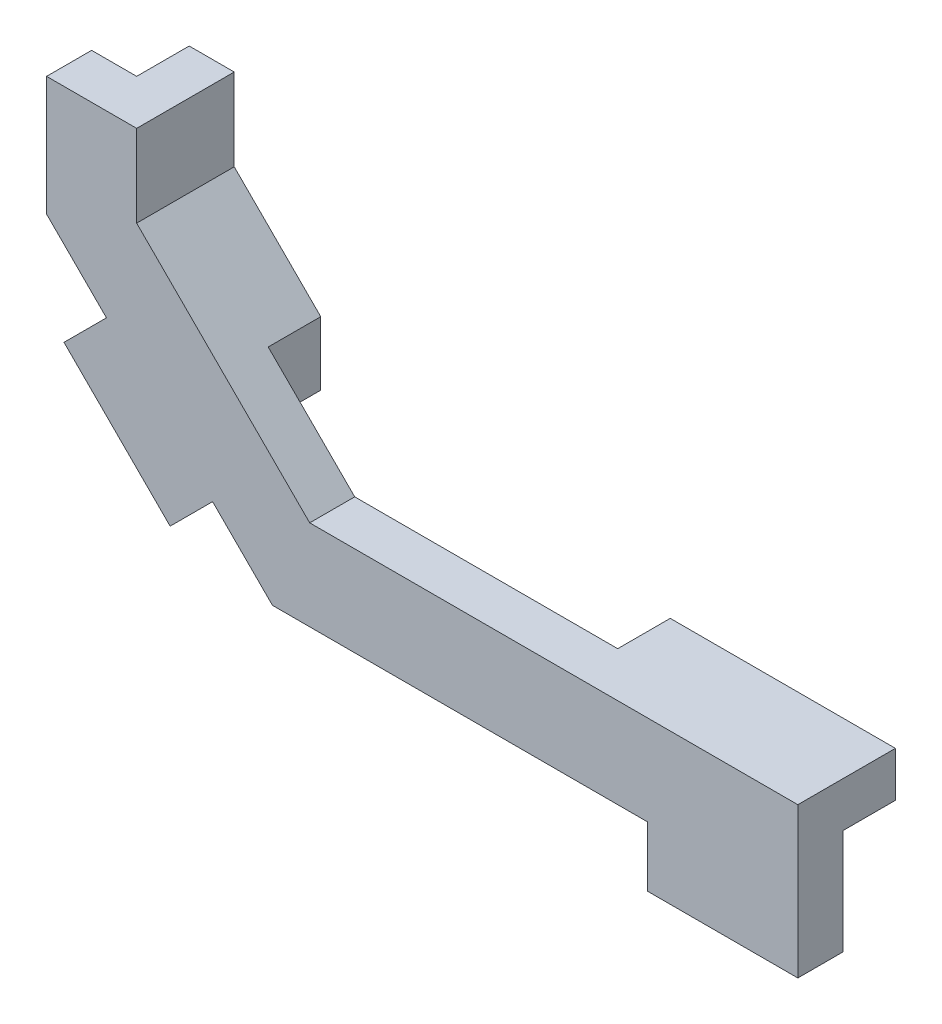
ISO-10303-21;
HEADER;
FILE_DESCRIPTION(('STEP AP214'),'2;1');
FILE_NAME('part.step','',(''),(''),'','','');
FILE_SCHEMA(('AUTOMOTIVE_DESIGN { 1 0 10303 214 1 1 1 1 }'));
ENDSEC;
DATA;
#1=APPLICATION_CONTEXT('core data for automotive mechanical design processes');
#2=APPLICATION_PROTOCOL_DEFINITION('international standard','automotive_design',2000,#1);
#3=PRODUCT_CONTEXT('',#1,'mechanical');
#4=PRODUCT('Part','Part','',(#3));
#5=PRODUCT_RELATED_PRODUCT_CATEGORY('part','',(#4));
#6=PRODUCT_DEFINITION_FORMATION('','',#4);
#7=PRODUCT_DEFINITION_CONTEXT('part definition',#1,'design');
#8=PRODUCT_DEFINITION('design','',#6,#7);
#9=PRODUCT_DEFINITION_SHAPE('','',#8);
#10=(LENGTH_UNIT() NAMED_UNIT(*) SI_UNIT(.MILLI.,.METRE.));
#11=(NAMED_UNIT(*) PLANE_ANGLE_UNIT() SI_UNIT($,.RADIAN.));
#12=(NAMED_UNIT(*) SI_UNIT($,.STERADIAN.) SOLID_ANGLE_UNIT());
#13=UNCERTAINTY_MEASURE_WITH_UNIT(LENGTH_MEASURE(1.E-05),#10,'distance_accuracy_value','');
#14=(GEOMETRIC_REPRESENTATION_CONTEXT(3) GLOBAL_UNCERTAINTY_ASSIGNED_CONTEXT((#13)) GLOBAL_UNIT_ASSIGNED_CONTEXT((#10,
#11,#12)) REPRESENTATION_CONTEXT('',''));
#15=CARTESIAN_POINT('',(0.,0.,0.));
#16=DIRECTION('',(0.,0.,1.));
#17=DIRECTION('',(1.,0.,0.));
#18=AXIS2_PLACEMENT_3D('',#15,#16,#17);
#19=CARTESIAN_POINT('',(-17.5,0.,30.414988602006));
#20=DIRECTION('',(-0.707106781186549,-0.707106781186546,0.));
#21=DIRECTION('',(0.707106781186546,-0.707106781186549,0.));
#22=AXIS2_PLACEMENT_3D('',#19,#20,#21);
#23=PLANE('',#22);
#24=DIRECTION('',(0.707106781186546,-0.707106781186549,0.));
#25=VECTOR('',#24,1.);
#26=CARTESIAN_POINT('',(-17.5,0.,1.5));
#27=LINE('',#26,#25);
#28=CARTESIAN_POINT('',(-21.4880822458921,3.98808224589213,1.5));
#29=VERTEX_POINT('',#28);
#30=CARTESIAN_POINT('',(-17.5,0.,1.5));
#31=VERTEX_POINT('',#30);
#32=EDGE_CURVE('E340',#29,#31,#27,.T.);
#33=ORIENTED_EDGE('',*,*,#32,.F.);
#34=DIRECTION('',(0.,0.,1.));
#35=VECTOR('',#34,1.);
#36=CARTESIAN_POINT('',(-21.4880822458921,3.98808224589213,1.5));
#37=LINE('',#36,#35);
#38=CARTESIAN_POINT('',(-21.4880822458921,3.98808224589213,-1.5));
#39=VERTEX_POINT('',#38);
#40=EDGE_CURVE('E416',#39,#29,#37,.T.);
#41=ORIENTED_EDGE('',*,*,#40,.F.);
#42=DIRECTION('',(-0.707106781186546,0.707106781186549,0.));
#43=VECTOR('',#42,1.);
#44=CARTESIAN_POINT('',(-17.5,0.,-1.5));
#45=LINE('',#44,#43);
#46=CARTESIAN_POINT('',(-17.5,0.,-1.5));
#47=VERTEX_POINT('',#46);
#48=EDGE_CURVE('E214',#47,#39,#45,.T.);
#49=ORIENTED_EDGE('',*,*,#48,.F.);
#50=DIRECTION('',(0.,0.,1.));
#51=VECTOR('',#50,1.);
#52=CARTESIAN_POINT('',(-17.5,0.,1.5));
#53=LINE('',#52,#51);
#54=EDGE_CURVE('E373',#47,#31,#53,.T.);
#55=ORIENTED_EDGE('',*,*,#54,.T.);
#56=EDGE_LOOP('',(#33,#41,#49,#55));
#57=FACE_BOUND('',#56,.T.);
#58=ADVANCED_FACE('F44',(#57),#23,.T.);
#59=CARTESIAN_POINT('',(-28.5591500577576,11.0591500577576,-1.5));
#60=VERTEX_POINT('',#59);
#61=CARTESIAN_POINT('',(-32.5472323036497,15.0472323036498,-1.5));
#62=VERTEX_POINT('',#61);
#63=EDGE_CURVE('E326',#60,#62,#45,.T.);
#64=ORIENTED_EDGE('',*,*,#63,.F.);
#65=DIRECTION('',(0.,0.,-1.));
#66=VECTOR('',#65,1.);
#67=CARTESIAN_POINT('',(-28.5591500577576,11.0591500577576,1.5));
#68=LINE('',#67,#66);
#69=CARTESIAN_POINT('',(-28.5591500577576,11.0591500577576,1.5));
#70=VERTEX_POINT('',#69);
#71=EDGE_CURVE('E209',#70,#60,#68,.T.);
#72=ORIENTED_EDGE('',*,*,#71,.F.);
#73=CARTESIAN_POINT('',(-32.5472323036497,15.0472323036498,1.5));
#74=VERTEX_POINT('',#73);
#75=EDGE_CURVE('E369',#74,#70,#27,.T.);
#76=ORIENTED_EDGE('',*,*,#75,.F.);
#77=DIRECTION('',(0.,0.,-1.));
#78=VECTOR('',#77,1.);
#79=CARTESIAN_POINT('',(-32.5472323036497,15.0472323036498,30.414988602006));
#80=LINE('',#79,#78);
#81=EDGE_CURVE('E353',#74,#62,#80,.T.);
#82=ORIENTED_EDGE('',*,*,#81,.T.);
#83=EDGE_LOOP('',(#64,#72,#76,#82));
#84=FACE_BOUND('',#83,.T.);
#85=ADVANCED_FACE('F433',(#84),#23,.T.);
#86=CARTESIAN_POINT('',(0.,0.,0.));
#87=DIRECTION('',(0.,1.,0.));
#88=DIRECTION('',(0.,0.,1.));
#89=AXIS2_PLACEMENT_3D('',#86,#87,#88);
#90=PLANE('',#89);
#91=DIRECTION('',(0.,0.,-1.));
#92=VECTOR('',#91,1.);
#93=CARTESIAN_POINT('',(7.5,0.,-1.5));
#94=LINE('',#93,#92);
#95=CARTESIAN_POINT('',(7.5,0.,1.5));
#96=VERTEX_POINT('',#95);
#97=CARTESIAN_POINT('',(7.5,0.,-1.5));
#98=VERTEX_POINT('',#97);
#99=EDGE_CURVE('E68',#96,#98,#94,.T.);
#100=ORIENTED_EDGE('',*,*,#99,.F.);
#101=DIRECTION('',(1.,0.,0.));
#102=VECTOR('',#101,1.);
#103=CARTESIAN_POINT('',(17.5,0.,1.5));
#104=LINE('',#103,#102);
#105=EDGE_CURVE('E388',#31,#96,#104,.T.);
#106=ORIENTED_EDGE('',*,*,#105,.F.);
#107=ORIENTED_EDGE('',*,*,#54,.F.);
#108=DIRECTION('',(-1.,0.,0.));
#109=VECTOR('',#108,1.);
#110=CARTESIAN_POINT('',(17.5,0.,-1.5));
#111=LINE('',#110,#109);
#112=EDGE_CURVE('E378',#98,#47,#111,.T.);
#113=ORIENTED_EDGE('',*,*,#112,.F.);
#114=EDGE_LOOP('',(#100,#106,#107,#113));
#115=FACE_BOUND('',#114,.T.);
#116=ADVANCED_FACE('F413',(#115),#90,.F.);
#117=CARTESIAN_POINT('',(17.5,6.,-1.5));
#118=DIRECTION('',(0.,0.,1.));
#119=DIRECTION('',(1.,0.,0.));
#120=AXIS2_PLACEMENT_3D('',#117,#118,#119);
#121=PLANE('',#120);
#122=DIRECTION('',(0.,-1.,0.));
#123=VECTOR('',#122,1.);
#124=CARTESIAN_POINT('',(-20.7836161518249,11.7636161518249,-1.5));
#125=LINE('',#124,#123);
#126=CARTESIAN_POINT('',(-20.7836161518249,11.7636161518249,-1.5));
#127=VERTEX_POINT('',#126);
#128=CARTESIAN_POINT('',(-20.7836161518249,7.52097546470559,-1.5));
#129=VERTEX_POINT('',#128);
#130=EDGE_CURVE('E271',#127,#129,#125,.T.);
#131=ORIENTED_EDGE('',*,*,#130,.F.);
#132=DIRECTION('',(0.707106781186546,-0.707106781186549,0.));
#133=VECTOR('',#132,1.);
#134=CARTESIAN_POINT('',(-26.5472323036497,17.5272323036498,-1.5));
#135=LINE('',#134,#133);
#136=CARTESIAN_POINT('',(-15.02,6.,-1.5));
#137=VERTEX_POINT('',#136);
#138=EDGE_CURVE('E350',#127,#137,#135,.T.);
#139=ORIENTED_EDGE('',*,*,#138,.T.);
#140=DIRECTION('',(-1.,0.,0.));
#141=VECTOR('',#140,1.);
#142=CARTESIAN_POINT('',(17.5,6.,-1.5));
#143=LINE('',#142,#141);
#144=CARTESIAN_POINT('',(2.5,6.,-1.5));
#145=VERTEX_POINT('',#144);
#146=EDGE_CURVE('E381',#145,#137,#143,.T.);
#147=ORIENTED_EDGE('',*,*,#146,.F.);
#148=DIRECTION('',(0.,1.,0.));
#149=VECTOR('',#148,1.);
#150=CARTESIAN_POINT('',(2.5,6.,-1.5));
#151=LINE('',#150,#149);
#152=CARTESIAN_POINT('',(2.5,3.,-1.5));
#153=VERTEX_POINT('',#152);
#154=EDGE_CURVE('E299',#153,#145,#151,.T.);
#155=ORIENTED_EDGE('',*,*,#154,.F.);
#156=DIRECTION('',(-1.,0.,0.));
#157=VECTOR('',#156,1.);
#158=CARTESIAN_POINT('',(2.5,3.,-1.5));
#159=LINE('',#158,#157);
#160=CARTESIAN_POINT('',(17.5,3.,-1.5));
#161=VERTEX_POINT('',#160);
#162=EDGE_CURVE('E275',#161,#153,#159,.T.);
#163=ORIENTED_EDGE('',*,*,#162,.F.);
#164=DIRECTION('',(0.,-1.,0.));
#165=VECTOR('',#164,1.);
#166=CARTESIAN_POINT('',(17.5,6.,-1.5));
#167=LINE('',#166,#165);
#168=CARTESIAN_POINT('',(17.5,-4.,-1.5));
#169=VERTEX_POINT('',#168);
#170=EDGE_CURVE('E53',#161,#169,#167,.T.);
#171=ORIENTED_EDGE('',*,*,#170,.T.);
#172=DIRECTION('',(1.,0.,0.));
#173=VECTOR('',#172,1.);
#174=CARTESIAN_POINT('',(7.5,-4.,-1.5));
#175=LINE('',#174,#173);
#176=CARTESIAN_POINT('',(7.5,-4.,-1.5));
#177=VERTEX_POINT('',#176);
#178=EDGE_CURVE('E233',#177,#169,#175,.T.);
#179=ORIENTED_EDGE('',*,*,#178,.F.);
#180=DIRECTION('',(0.,1.,0.));
#181=VECTOR('',#180,1.);
#182=CARTESIAN_POINT('',(7.5,-4.,-1.5));
#183=LINE('',#182,#181);
#184=EDGE_CURVE('E236',#177,#98,#183,.T.);
#185=ORIENTED_EDGE('',*,*,#184,.T.);
#186=ORIENTED_EDGE('',*,*,#112,.T.);
#187=ORIENTED_EDGE('',*,*,#48,.T.);
#188=DIRECTION('',(0.707106781186549,0.707106781186546,0.));
#189=VECTOR('',#188,1.);
#190=CARTESIAN_POINT('',(-24.3165093706383,1.15965512114594,-1.5));
#191=LINE('',#190,#189);
#192=CARTESIAN_POINT('',(-24.3165093706383,1.15965512114594,-1.5));
#193=VERTEX_POINT('',#192);
#194=EDGE_CURVE('E192',#193,#39,#191,.T.);
#195=ORIENTED_EDGE('',*,*,#194,.F.);
#196=DIRECTION('',(0.707106781186546,-0.707106781186549,0.));
#197=VECTOR('',#196,1.);
#198=CARTESIAN_POINT('',(-24.3165093706383,1.15965512114594,-1.5));
#199=LINE('',#198,#197);
#200=CARTESIAN_POINT('',(-31.3875771825038,8.23072293301143,-1.5));
#201=VERTEX_POINT('',#200);
#202=EDGE_CURVE('E200',#201,#193,#199,.T.);
#203=ORIENTED_EDGE('',*,*,#202,.F.);
#204=DIRECTION('',(0.707106781186549,0.707106781186546,0.));
#205=VECTOR('',#204,1.);
#206=CARTESIAN_POINT('',(-31.3875771825038,8.23072293301143,-1.5));
#207=LINE('',#206,#205);
#208=EDGE_CURVE('E424',#201,#60,#207,.T.);
#209=ORIENTED_EDGE('',*,*,#208,.T.);
#210=ORIENTED_EDGE('',*,*,#63,.T.);
#211=DIRECTION('',(0.,1.,0.));
#212=VECTOR('',#211,1.);
#213=CARTESIAN_POINT('',(-32.5472323036497,15.0472323036498,-1.5));
#214=LINE('',#213,#212);
#215=CARTESIAN_POINT('',(-32.5472323036497,22.9972323036498,-1.5));
#216=VERTEX_POINT('',#215);
#217=EDGE_CURVE('E343',#62,#216,#214,.T.);
#218=ORIENTED_EDGE('',*,*,#217,.T.);
#219=DIRECTION('',(1.,0.,0.));
#220=VECTOR('',#219,1.);
#221=CARTESIAN_POINT('',(-32.5472323036497,22.9972323036498,-1.5));
#222=LINE('',#221,#220);
#223=CARTESIAN_POINT('',(-29.5472323036497,22.9972323036498,-1.5));
#224=VERTEX_POINT('',#223);
#225=EDGE_CURVE('E347',#216,#224,#222,.T.);
#226=ORIENTED_EDGE('',*,*,#225,.T.);
#227=DIRECTION('',(0.,1.,0.));
#228=VECTOR('',#227,1.);
#229=CARTESIAN_POINT('',(-29.5472323036497,22.9972323036498,-1.5));
#230=LINE('',#229,#228);
#231=CARTESIAN_POINT('',(-29.5472323036497,16.2845916165305,-1.5));
#232=VERTEX_POINT('',#231);
#233=EDGE_CURVE('E262',#232,#224,#230,.T.);
#234=ORIENTED_EDGE('',*,*,#233,.F.);
#235=DIRECTION('',(-0.707106781186545,0.70710678118655,0.));
#236=VECTOR('',#235,1.);
#237=CARTESIAN_POINT('',(-29.5472323036497,16.2845916165305,-1.5));
#238=LINE('',#237,#236);
#239=EDGE_CURVE('E266',#129,#232,#238,.T.);
#240=ORIENTED_EDGE('',*,*,#239,.F.);
#241=EDGE_LOOP('',(#131,#139,#147,#155,#163,#171,#179,#185,#186,#187,#195,#203,#209,#210,#218,
#226,#234,#240));
#242=FACE_BOUND('',#241,.T.);
#243=ADVANCED_FACE('F212',(#242),#121,.F.);
#244=CARTESIAN_POINT('',(17.5,6.,1.5));
#245=DIRECTION('',(0.,0.,-1.));
#246=DIRECTION('',(-1.,0.,0.));
#247=AXIS2_PLACEMENT_3D('',#244,#245,#246);
#248=PLANE('',#247);
#249=ORIENTED_EDGE('',*,*,#75,.T.);
#250=DIRECTION('',(0.707106781186549,0.707106781186546,0.));
#251=VECTOR('',#250,1.);
#252=CARTESIAN_POINT('',(-31.3875771825038,8.23072293301143,1.5));
#253=LINE('',#252,#251);
#254=CARTESIAN_POINT('',(-31.3875771825038,8.23072293301143,1.5));
#255=VERTEX_POINT('',#254);
#256=EDGE_CURVE('E60',#255,#70,#253,.T.);
#257=ORIENTED_EDGE('',*,*,#256,.F.);
#258=DIRECTION('',(-0.707106781186546,0.707106781186549,0.));
#259=VECTOR('',#258,1.);
#260=CARTESIAN_POINT('',(-24.3165093706383,1.15965512114594,1.5));
#261=LINE('',#260,#259);
#262=CARTESIAN_POINT('',(-24.3165093706383,1.15965512114594,1.5));
#263=VERTEX_POINT('',#262);
#264=EDGE_CURVE('E199',#263,#255,#261,.T.);
#265=ORIENTED_EDGE('',*,*,#264,.F.);
#266=DIRECTION('',(0.707106781186549,0.707106781186546,0.));
#267=VECTOR('',#266,1.);
#268=CARTESIAN_POINT('',(-24.3165093706383,1.15965512114594,1.5));
#269=LINE('',#268,#267);
#270=EDGE_CURVE('E195',#263,#29,#269,.T.);
#271=ORIENTED_EDGE('',*,*,#270,.T.);
#272=ORIENTED_EDGE('',*,*,#32,.T.);
#273=ORIENTED_EDGE('',*,*,#105,.T.);
#274=DIRECTION('',(0.,1.,0.));
#275=VECTOR('',#274,1.);
#276=CARTESIAN_POINT('',(7.5,-4.,1.5));
#277=LINE('',#276,#275);
#278=CARTESIAN_POINT('',(7.5,-4.,1.5));
#279=VERTEX_POINT('',#278);
#280=EDGE_CURVE('E241',#279,#96,#277,.T.);
#281=ORIENTED_EDGE('',*,*,#280,.F.);
#282=DIRECTION('',(-1.,0.,0.));
#283=VECTOR('',#282,1.);
#284=CARTESIAN_POINT('',(7.5,-4.,1.5));
#285=LINE('',#284,#283);
#286=CARTESIAN_POINT('',(17.5,-4.,1.5));
#287=VERTEX_POINT('',#286);
#288=EDGE_CURVE('E227',#287,#279,#285,.T.);
#289=ORIENTED_EDGE('',*,*,#288,.F.);
#290=DIRECTION('',(0.,-1.,0.));
#291=VECTOR('',#290,1.);
#292=CARTESIAN_POINT('',(17.5,6.,1.5));
#293=LINE('',#292,#291);
#294=CARTESIAN_POINT('',(17.5,6.,1.5));
#295=VERTEX_POINT('',#294);
#296=EDGE_CURVE('E11',#295,#287,#293,.T.);
#297=ORIENTED_EDGE('',*,*,#296,.F.);
#298=DIRECTION('',(1.,0.,0.));
#299=VECTOR('',#298,1.);
#300=CARTESIAN_POINT('',(17.5,6.,1.5));
#301=LINE('',#300,#299);
#302=CARTESIAN_POINT('',(-15.02,6.,1.5));
#303=VERTEX_POINT('',#302);
#304=EDGE_CURVE('E374',#303,#295,#301,.T.);
#305=ORIENTED_EDGE('',*,*,#304,.F.);
#306=DIRECTION('',(-0.707106781186546,0.707106781186549,0.));
#307=VECTOR('',#306,1.);
#308=CARTESIAN_POINT('',(-26.5472323036497,17.5272323036498,1.5));
#309=LINE('',#308,#307);
#310=CARTESIAN_POINT('',(-26.5472323036497,17.5272323036498,1.5));
#311=VERTEX_POINT('',#310);
#312=EDGE_CURVE('E337',#303,#311,#309,.T.);
#313=ORIENTED_EDGE('',*,*,#312,.T.);
#314=DIRECTION('',(0.,1.,0.));
#315=VECTOR('',#314,1.);
#316=CARTESIAN_POINT('',(-26.5472323036497,22.9972323036498,1.5));
#317=LINE('',#316,#315);
#318=CARTESIAN_POINT('',(-26.5472323036497,22.9972323036498,1.5));
#319=VERTEX_POINT('',#318);
#320=EDGE_CURVE('E334',#311,#319,#317,.T.);
#321=ORIENTED_EDGE('',*,*,#320,.T.);
#322=DIRECTION('',(-1.,0.,0.));
#323=VECTOR('',#322,1.);
#324=CARTESIAN_POINT('',(-32.5472323036497,22.9972323036498,1.5));
#325=LINE('',#324,#323);
#326=CARTESIAN_POINT('',(-32.5472323036497,22.9972323036498,1.5));
#327=VERTEX_POINT('',#326);
#328=EDGE_CURVE('E330',#319,#327,#325,.T.);
#329=ORIENTED_EDGE('',*,*,#328,.T.);
#330=DIRECTION('',(0.,-1.,0.));
#331=VECTOR('',#330,1.);
#332=CARTESIAN_POINT('',(-32.5472323036497,15.0472323036498,1.5));
#333=LINE('',#332,#331);
#334=EDGE_CURVE('E327',#327,#74,#333,.T.);
#335=ORIENTED_EDGE('',*,*,#334,.T.);
#336=EDGE_LOOP('',(#249,#257,#265,#271,#272,#273,#281,#289,#297,#305,#313,#321,#329,#335));
#337=FACE_BOUND('',#336,.T.);
#338=ADVANCED_FACE('F46',(#337),#248,.F.);
#339=CARTESIAN_POINT('',(17.5,6.,1.5));
#340=DIRECTION('',(-1.,0.,0.));
#341=DIRECTION('',(0.,0.,1.));
#342=AXIS2_PLACEMENT_3D('',#339,#340,#341);
#343=PLANE('',#342);
#344=ORIENTED_EDGE('',*,*,#296,.T.);
#345=DIRECTION('',(0.,0.,1.));
#346=VECTOR('',#345,1.);
#347=CARTESIAN_POINT('',(17.5,-4.,-1.5));
#348=LINE('',#347,#346);
#349=EDGE_CURVE('E219',#169,#287,#348,.T.);
#350=ORIENTED_EDGE('',*,*,#349,.F.);
#351=ORIENTED_EDGE('',*,*,#170,.F.);
#352=DIRECTION('',(0.,0.,1.));
#353=VECTOR('',#352,1.);
#354=CARTESIAN_POINT('',(17.5,3.,-5.));
#355=LINE('',#354,#353);
#356=CARTESIAN_POINT('',(17.5,3.,-5.));
#357=VERTEX_POINT('',#356);
#358=EDGE_CURVE('E322',#357,#161,#355,.T.);
#359=ORIENTED_EDGE('',*,*,#358,.F.);
#360=DIRECTION('',(0.,-1.,0.));
#361=VECTOR('',#360,1.);
#362=CARTESIAN_POINT('',(17.5,6.,-5.));
#363=LINE('',#362,#361);
#364=CARTESIAN_POINT('',(17.5,6.,-5.));
#365=VERTEX_POINT('',#364);
#366=EDGE_CURVE('E298',#365,#357,#363,.T.);
#367=ORIENTED_EDGE('',*,*,#366,.F.);
#368=DIRECTION('',(0.,0.,-1.));
#369=VECTOR('',#368,1.);
#370=CARTESIAN_POINT('',(17.5,6.,1.5));
#371=LINE('',#370,#369);
#372=EDGE_CURVE('E377',#295,#365,#371,.T.);
#373=ORIENTED_EDGE('',*,*,#372,.F.);
#374=EDGE_LOOP('',(#344,#350,#351,#359,#367,#373));
#375=FACE_BOUND('',#374,.T.);
#376=ADVANCED_FACE('F402',(#375),#343,.F.);
#377=CARTESIAN_POINT('',(0.,6.,0.));
#378=DIRECTION('',(0.,1.,0.));
#379=DIRECTION('',(0.,0.,1.));
#380=AXIS2_PLACEMENT_3D('',#377,#378,#379);
#381=PLANE('',#380);
#382=DIRECTION('',(0.,0.,-1.));
#383=VECTOR('',#382,1.);
#384=CARTESIAN_POINT('',(-15.02,6.,30.414988602006));
#385=LINE('',#384,#383);
#386=EDGE_CURVE('E331',#303,#137,#385,.T.);
#387=ORIENTED_EDGE('',*,*,#386,.F.);
#388=ORIENTED_EDGE('',*,*,#304,.T.);
#389=ORIENTED_EDGE('',*,*,#372,.T.);
#390=DIRECTION('',(1.,0.,0.));
#391=VECTOR('',#390,1.);
#392=CARTESIAN_POINT('',(17.5,6.,-5.));
#393=LINE('',#392,#391);
#394=CARTESIAN_POINT('',(2.5,6.,-5.));
#395=VERTEX_POINT('',#394);
#396=EDGE_CURVE('E294',#395,#365,#393,.T.);
#397=ORIENTED_EDGE('',*,*,#396,.F.);
#398=DIRECTION('',(0.,0.,1.));
#399=VECTOR('',#398,1.);
#400=CARTESIAN_POINT('',(2.5,6.,-5.));
#401=LINE('',#400,#399);
#402=EDGE_CURVE('E308',#395,#145,#401,.T.);
#403=ORIENTED_EDGE('',*,*,#402,.T.);
#404=ORIENTED_EDGE('',*,*,#146,.T.);
#405=EDGE_LOOP('',(#387,#388,#389,#397,#403,#404));
#406=FACE_BOUND('',#405,.T.);
#407=ADVANCED_FACE('F474',(#406),#381,.T.);
#408=CARTESIAN_POINT('',(-26.5472323036497,17.5272323036498,30.414988602006));
#409=DIRECTION('',(0.707106781186549,0.707106781186546,0.));
#410=DIRECTION('',(-0.707106781186546,0.707106781186549,0.));
#411=AXIS2_PLACEMENT_3D('',#408,#409,#410);
#412=PLANE('',#411);
#413=ORIENTED_EDGE('',*,*,#312,.F.);
#414=ORIENTED_EDGE('',*,*,#386,.T.);
#415=ORIENTED_EDGE('',*,*,#138,.F.);
#416=DIRECTION('',(0.,0.,1.));
#417=VECTOR('',#416,1.);
#418=CARTESIAN_POINT('',(-20.7836161518249,11.7636161518249,-5.));
#419=LINE('',#418,#417);
#420=CARTESIAN_POINT('',(-20.7836161518249,11.7636161518249,-5.));
#421=VERTEX_POINT('',#420);
#422=EDGE_CURVE('E245',#421,#127,#419,.T.);
#423=ORIENTED_EDGE('',*,*,#422,.F.);
#424=DIRECTION('',(0.707106781186546,-0.707106781186549,0.));
#425=VECTOR('',#424,1.);
#426=CARTESIAN_POINT('',(-20.7836161518249,11.7636161518249,-5.));
#427=LINE('',#426,#425);
#428=CARTESIAN_POINT('',(-26.5472323036497,17.5272323036498,-5.));
#429=VERTEX_POINT('',#428);
#430=EDGE_CURVE('E288',#429,#421,#427,.T.);
#431=ORIENTED_EDGE('',*,*,#430,.F.);
#432=DIRECTION('',(0.,0.,-1.));
#433=VECTOR('',#432,1.);
#434=CARTESIAN_POINT('',(-26.5472323036497,17.5272323036498,30.414988602006));
#435=LINE('',#434,#433);
#436=EDGE_CURVE('E357',#311,#429,#435,.T.);
#437=ORIENTED_EDGE('',*,*,#436,.F.);
#438=EDGE_LOOP('',(#413,#414,#415,#423,#431,#437));
#439=FACE_BOUND('',#438,.T.);
#440=ADVANCED_FACE('F464',(#439),#412,.T.);
#441=CARTESIAN_POINT('',(-26.5472323036497,22.9972323036498,30.414988602006));
#442=DIRECTION('',(1.,0.,0.));
#443=DIRECTION('',(0.,0.,-1.));
#444=AXIS2_PLACEMENT_3D('',#441,#442,#443);
#445=PLANE('',#444);
#446=ORIENTED_EDGE('',*,*,#320,.F.);
#447=ORIENTED_EDGE('',*,*,#436,.T.);
#448=DIRECTION('',(0.,-1.,0.));
#449=VECTOR('',#448,1.);
#450=CARTESIAN_POINT('',(-26.5472323036497,17.5272323036498,-5.));
#451=LINE('',#450,#449);
#452=CARTESIAN_POINT('',(-26.5472323036497,22.9972323036498,-5.));
#453=VERTEX_POINT('',#452);
#454=EDGE_CURVE('E267',#453,#429,#451,.T.);
#455=ORIENTED_EDGE('',*,*,#454,.F.);
#456=DIRECTION('',(0.,0.,-1.));
#457=VECTOR('',#456,1.);
#458=CARTESIAN_POINT('',(-26.5472323036497,22.9972323036498,30.414988602006));
#459=LINE('',#458,#457);
#460=EDGE_CURVE('E360',#319,#453,#459,.T.);
#461=ORIENTED_EDGE('',*,*,#460,.F.);
#462=EDGE_LOOP('',(#446,#447,#455,#461));
#463=FACE_BOUND('',#462,.T.);
#464=ADVANCED_FACE('F458',(#463),#445,.T.);
#465=CARTESIAN_POINT('',(-32.5472323036497,22.9972323036498,30.414988602006));
#466=DIRECTION('',(0.,1.,0.));
#467=DIRECTION('',(0.,0.,1.));
#468=AXIS2_PLACEMENT_3D('',#465,#466,#467);
#469=PLANE('',#468);
#470=ORIENTED_EDGE('',*,*,#328,.F.);
#471=ORIENTED_EDGE('',*,*,#460,.T.);
#472=DIRECTION('',(1.,0.,0.));
#473=VECTOR('',#472,1.);
#474=CARTESIAN_POINT('',(-26.5472323036497,22.9972323036498,-5.));
#475=LINE('',#474,#473);
#476=CARTESIAN_POINT('',(-29.5472323036497,22.9972323036498,-5.));
#477=VERTEX_POINT('',#476);
#478=EDGE_CURVE('E261',#477,#453,#475,.T.);
#479=ORIENTED_EDGE('',*,*,#478,.F.);
#480=DIRECTION('',(0.,0.,1.));
#481=VECTOR('',#480,1.);
#482=CARTESIAN_POINT('',(-29.5472323036497,22.9972323036498,-5.));
#483=LINE('',#482,#481);
#484=EDGE_CURVE('E257',#477,#224,#483,.T.);
#485=ORIENTED_EDGE('',*,*,#484,.T.);
#486=ORIENTED_EDGE('',*,*,#225,.F.);
#487=DIRECTION('',(0.,0.,-1.));
#488=VECTOR('',#487,1.);
#489=CARTESIAN_POINT('',(-32.5472323036497,22.9972323036498,30.414988602006));
#490=LINE('',#489,#488);
#491=EDGE_CURVE('E363',#327,#216,#490,.T.);
#492=ORIENTED_EDGE('',*,*,#491,.F.);
#493=EDGE_LOOP('',(#470,#471,#479,#485,#486,#492));
#494=FACE_BOUND('',#493,.T.);
#495=ADVANCED_FACE('F451',(#494),#469,.T.);
#496=CARTESIAN_POINT('',(-32.5472323036497,15.0472323036498,30.414988602006));
#497=DIRECTION('',(-1.,0.,0.));
#498=DIRECTION('',(0.,0.,1.));
#499=AXIS2_PLACEMENT_3D('',#496,#497,#498);
#500=PLANE('',#499);
#501=ORIENTED_EDGE('',*,*,#334,.F.);
#502=ORIENTED_EDGE('',*,*,#491,.T.);
#503=ORIENTED_EDGE('',*,*,#217,.F.);
#504=ORIENTED_EDGE('',*,*,#81,.F.);
#505=EDGE_LOOP('',(#501,#502,#503,#504));
#506=FACE_BOUND('',#505,.T.);
#507=ADVANCED_FACE('F440',(#506),#500,.T.);
#508=CARTESIAN_POINT('',(2.5,3.,-5.));
#509=DIRECTION('',(0.,1.,0.));
#510=DIRECTION('',(-1.,0.,0.));
#511=AXIS2_PLACEMENT_3D('',#508,#509,#510);
#512=PLANE('',#511);
#513=ORIENTED_EDGE('',*,*,#162,.T.);
#514=DIRECTION('',(0.,0.,1.));
#515=VECTOR('',#514,1.);
#516=CARTESIAN_POINT('',(2.5,3.,-5.));
#517=LINE('',#516,#515);
#518=CARTESIAN_POINT('',(2.5,3.,-5.));
#519=VERTEX_POINT('',#518);
#520=EDGE_CURVE('E318',#519,#153,#517,.T.);
#521=ORIENTED_EDGE('',*,*,#520,.F.);
#522=DIRECTION('',(-1.,0.,0.));
#523=VECTOR('',#522,1.);
#524=CARTESIAN_POINT('',(2.5,3.,-5.));
#525=LINE('',#524,#523);
#526=EDGE_CURVE('E302',#357,#519,#525,.T.);
#527=ORIENTED_EDGE('',*,*,#526,.F.);
#528=ORIENTED_EDGE('',*,*,#358,.T.);
#529=EDGE_LOOP('',(#513,#521,#527,#528));
#530=FACE_BOUND('',#529,.T.);
#531=ADVANCED_FACE('F483',(#530),#512,.F.);
#532=CARTESIAN_POINT('',(2.5,6.,-5.));
#533=DIRECTION('',(1.,0.,0.));
#534=DIRECTION('',(0.,1.,0.));
#535=AXIS2_PLACEMENT_3D('',#532,#533,#534);
#536=PLANE('',#535);
#537=ORIENTED_EDGE('',*,*,#154,.T.);
#538=ORIENTED_EDGE('',*,*,#402,.F.);
#539=DIRECTION('',(0.,1.,0.));
#540=VECTOR('',#539,1.);
#541=CARTESIAN_POINT('',(2.5,6.,-5.));
#542=LINE('',#541,#540);
#543=EDGE_CURVE('E305',#519,#395,#542,.T.);
#544=ORIENTED_EDGE('',*,*,#543,.F.);
#545=ORIENTED_EDGE('',*,*,#520,.T.);
#546=EDGE_LOOP('',(#537,#538,#544,#545));
#547=FACE_BOUND('',#546,.T.);
#548=ADVANCED_FACE('F478',(#547),#536,.F.);
#549=CARTESIAN_POINT('',(0.,0.,-5.));
#550=DIRECTION('',(0.,0.,1.));
#551=DIRECTION('',(1.,0.,0.));
#552=AXIS2_PLACEMENT_3D('',#549,#550,#551);
#553=PLANE('',#552);
#554=ORIENTED_EDGE('',*,*,#396,.T.);
#555=ORIENTED_EDGE('',*,*,#366,.T.);
#556=ORIENTED_EDGE('',*,*,#526,.T.);
#557=ORIENTED_EDGE('',*,*,#543,.T.);
#558=EDGE_LOOP('',(#554,#555,#556,#557));
#559=FACE_BOUND('',#558,.T.);
#560=ADVANCED_FACE('F485',(#559),#553,.F.);
#561=CARTESIAN_POINT('',(-20.7836161518249,11.7636161518249,-5.));
#562=DIRECTION('',(-1.,0.,0.));
#563=DIRECTION('',(0.,0.,1.));
#564=AXIS2_PLACEMENT_3D('',#561,#562,#563);
#565=PLANE('',#564);
#566=ORIENTED_EDGE('',*,*,#130,.T.);
#567=DIRECTION('',(0.,0.,1.));
#568=VECTOR('',#567,1.);
#569=CARTESIAN_POINT('',(-20.7836161518249,7.52097546470559,-5.));
#570=LINE('',#569,#568);
#571=CARTESIAN_POINT('',(-20.7836161518249,7.52097546470559,-5.));
#572=VERTEX_POINT('',#571);
#573=EDGE_CURVE('E249',#572,#129,#570,.T.);
#574=ORIENTED_EDGE('',*,*,#573,.F.);
#575=DIRECTION('',(0.,-1.,0.));
#576=VECTOR('',#575,1.);
#577=CARTESIAN_POINT('',(-20.7836161518249,11.7636161518249,-5.));
#578=LINE('',#577,#576);
#579=EDGE_CURVE('E285',#421,#572,#578,.T.);
#580=ORIENTED_EDGE('',*,*,#579,.F.);
#581=ORIENTED_EDGE('',*,*,#422,.T.);
#582=EDGE_LOOP('',(#566,#574,#580,#581));
#583=FACE_BOUND('',#582,.T.);
#584=ADVANCED_FACE('F470',(#583),#565,.F.);
#585=CARTESIAN_POINT('',(-29.5472323036497,16.2845916165305,-5.));
#586=DIRECTION('',(0.70710678118655,0.707106781186545,0.));
#587=DIRECTION('',(-0.707106781186545,0.70710678118655,0.));
#588=AXIS2_PLACEMENT_3D('',#585,#586,#587);
#589=PLANE('',#588);
#590=ORIENTED_EDGE('',*,*,#239,.T.);
#591=DIRECTION('',(0.,0.,1.));
#592=VECTOR('',#591,1.);
#593=CARTESIAN_POINT('',(-29.5472323036497,16.2845916165305,-5.));
#594=LINE('',#593,#592);
#595=CARTESIAN_POINT('',(-29.5472323036497,16.2845916165305,-5.));
#596=VERTEX_POINT('',#595);
#597=EDGE_CURVE('E253',#596,#232,#594,.T.);
#598=ORIENTED_EDGE('',*,*,#597,.F.);
#599=DIRECTION('',(-0.707106781186545,0.70710678118655,0.));
#600=VECTOR('',#599,1.);
#601=CARTESIAN_POINT('',(-29.5472323036497,16.2845916165305,-5.));
#602=LINE('',#601,#600);
#603=EDGE_CURVE('E282',#572,#596,#602,.T.);
#604=ORIENTED_EDGE('',*,*,#603,.F.);
#605=ORIENTED_EDGE('',*,*,#573,.T.);
#606=EDGE_LOOP('',(#590,#598,#604,#605));
#607=FACE_BOUND('',#606,.T.);
#608=ADVANCED_FACE('F472',(#607),#589,.F.);
#609=CARTESIAN_POINT('',(-29.5472323036497,22.9972323036498,-5.));
#610=DIRECTION('',(1.,0.,0.));
#611=DIRECTION('',(0.,0.,-1.));
#612=AXIS2_PLACEMENT_3D('',#609,#610,#611);
#613=PLANE('',#612);
#614=ORIENTED_EDGE('',*,*,#233,.T.);
#615=ORIENTED_EDGE('',*,*,#484,.F.);
#616=DIRECTION('',(0.,1.,0.));
#617=VECTOR('',#616,1.);
#618=CARTESIAN_POINT('',(-29.5472323036497,22.9972323036498,-5.));
#619=LINE('',#618,#617);
#620=EDGE_CURVE('E279',#596,#477,#619,.T.);
#621=ORIENTED_EDGE('',*,*,#620,.F.);
#622=ORIENTED_EDGE('',*,*,#597,.T.);
#623=EDGE_LOOP('',(#614,#615,#621,#622));
#624=FACE_BOUND('',#623,.T.);
#625=ADVANCED_FACE('F446',(#624),#613,.F.);
#626=CARTESIAN_POINT('',(0.,0.,-5.));
#627=DIRECTION('',(0.,0.,1.));
#628=DIRECTION('',(1.,0.,0.));
#629=AXIS2_PLACEMENT_3D('',#626,#627,#628);
#630=PLANE('',#629);
#631=ORIENTED_EDGE('',*,*,#454,.T.);
#632=ORIENTED_EDGE('',*,*,#430,.T.);
#633=ORIENTED_EDGE('',*,*,#579,.T.);
#634=ORIENTED_EDGE('',*,*,#603,.T.);
#635=ORIENTED_EDGE('',*,*,#620,.T.);
#636=ORIENTED_EDGE('',*,*,#478,.T.);
#637=EDGE_LOOP('',(#631,#632,#633,#634,#635,#636));
#638=FACE_BOUND('',#637,.T.);
#639=ADVANCED_FACE('F455',(#638),#630,.F.);
#640=CARTESIAN_POINT('',(7.5,-4.,-1.5));
#641=DIRECTION('',(1.,0.,0.));
#642=DIRECTION('',(0.,0.,-1.));
#643=AXIS2_PLACEMENT_3D('',#640,#641,#642);
#644=PLANE('',#643);
#645=ORIENTED_EDGE('',*,*,#99,.T.);
#646=ORIENTED_EDGE('',*,*,#184,.F.);
#647=DIRECTION('',(0.,0.,-1.));
#648=VECTOR('',#647,1.);
#649=CARTESIAN_POINT('',(7.5,-4.,-1.5));
#650=LINE('',#649,#648);
#651=EDGE_CURVE('E230',#279,#177,#650,.T.);
#652=ORIENTED_EDGE('',*,*,#651,.F.);
#653=ORIENTED_EDGE('',*,*,#280,.T.);
#654=EDGE_LOOP('',(#645,#646,#652,#653));
#655=FACE_BOUND('',#654,.T.);
#656=ADVANCED_FACE('F411',(#655),#644,.F.);
#657=CARTESIAN_POINT('',(0.,-4.,0.));
#658=DIRECTION('',(0.,1.,0.));
#659=DIRECTION('',(0.,0.,1.));
#660=AXIS2_PLACEMENT_3D('',#657,#658,#659);
#661=PLANE('',#660);
#662=ORIENTED_EDGE('',*,*,#349,.T.);
#663=ORIENTED_EDGE('',*,*,#288,.T.);
#664=ORIENTED_EDGE('',*,*,#651,.T.);
#665=ORIENTED_EDGE('',*,*,#178,.T.);
#666=EDGE_LOOP('',(#662,#663,#664,#665));
#667=FACE_BOUND('',#666,.T.);
#668=ADVANCED_FACE('F399',(#667),#661,.F.);
#669=CARTESIAN_POINT('',(-24.3165093706383,1.15965512114594,1.5));
#670=DIRECTION('',(-0.707106781186546,0.707106781186549,0.));
#671=DIRECTION('',(-0.707106781186549,-0.707106781186546,0.));
#672=AXIS2_PLACEMENT_3D('',#669,#670,#671);
#673=PLANE('',#672);
#674=ORIENTED_EDGE('',*,*,#40,.T.);
#675=ORIENTED_EDGE('',*,*,#270,.F.);
#676=DIRECTION('',(0.,0.,1.));
#677=VECTOR('',#676,1.);
#678=CARTESIAN_POINT('',(-24.3165093706383,1.15965512114594,1.5));
#679=LINE('',#678,#677);
#680=EDGE_CURVE('E188',#193,#263,#679,.T.);
#681=ORIENTED_EDGE('',*,*,#680,.F.);
#682=ORIENTED_EDGE('',*,*,#194,.T.);
#683=EDGE_LOOP('',(#674,#675,#681,#682));
#684=FACE_BOUND('',#683,.T.);
#685=ADVANCED_FACE('F190',(#684),#673,.F.);
#686=CARTESIAN_POINT('',(-31.3875771825038,8.23072293301143,1.5));
#687=DIRECTION('',(0.707106781186546,-0.707106781186549,0.));
#688=DIRECTION('',(0.707106781186549,0.707106781186546,0.));
#689=AXIS2_PLACEMENT_3D('',#686,#687,#688);
#690=PLANE('',#689);
#691=ORIENTED_EDGE('',*,*,#71,.T.);
#692=ORIENTED_EDGE('',*,*,#208,.F.);
#693=DIRECTION('',(0.,0.,-1.));
#694=VECTOR('',#693,1.);
#695=CARTESIAN_POINT('',(-31.3875771825038,8.23072293301143,1.5));
#696=LINE('',#695,#694);
#697=EDGE_CURVE('E204',#255,#201,#696,.T.);
#698=ORIENTED_EDGE('',*,*,#697,.F.);
#699=ORIENTED_EDGE('',*,*,#256,.T.);
#700=EDGE_LOOP('',(#691,#692,#698,#699));
#701=FACE_BOUND('',#700,.T.);
#702=ADVANCED_FACE('F430',(#701),#690,.F.);
#703=CARTESIAN_POINT('',(-11.5784271247462,-11.5784271247462,0.));
#704=DIRECTION('',(-0.707106781186549,-0.707106781186546,0.));
#705=DIRECTION('',(0.707106781186546,-0.707106781186549,0.));
#706=AXIS2_PLACEMENT_3D('',#703,#704,#705);
#707=PLANE('',#706);
#708=ORIENTED_EDGE('',*,*,#202,.T.);
#709=ORIENTED_EDGE('',*,*,#680,.T.);
#710=ORIENTED_EDGE('',*,*,#264,.T.);
#711=ORIENTED_EDGE('',*,*,#697,.T.);
#712=EDGE_LOOP('',(#708,#709,#710,#711));
#713=FACE_BOUND('',#712,.T.);
#714=ADVANCED_FACE('F203',(#713),#707,.T.);
#715=CLOSED_SHELL('',(#58,#85,#116,#243,#338,#376,#407,#440,#464,#495,#507,#531,#548,#560,#584,
#608,#625,#639,#656,#668,#685,#702,#714));
#716=MANIFOLD_SOLID_BREP('B2',#715);
#717=ADVANCED_BREP_SHAPE_REPRESENTATION('',(#18,#716),#14);
#718=SHAPE_DEFINITION_REPRESENTATION(#9,#717);
ENDSEC;
END-ISO-10303-21;
